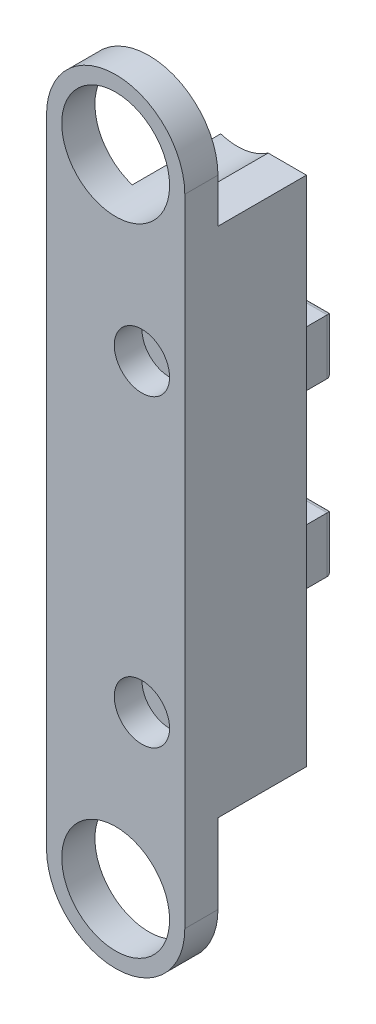
ISO-10303-21;
HEADER;
FILE_DESCRIPTION(('STEP AP214'),'2;1');
FILE_NAME('part.step','',(''),(''),'','','');
FILE_SCHEMA(('AUTOMOTIVE_DESIGN { 1 0 10303 214 1 1 1 1 }'));
ENDSEC;
DATA;
#1=APPLICATION_CONTEXT('core data for automotive mechanical design processes');
#2=APPLICATION_PROTOCOL_DEFINITION('international standard','automotive_design',2000,#1);
#3=PRODUCT_CONTEXT('',#1,'mechanical');
#4=PRODUCT('Part','Part','',(#3));
#5=PRODUCT_RELATED_PRODUCT_CATEGORY('part','',(#4));
#6=PRODUCT_DEFINITION_FORMATION('','',#4);
#7=PRODUCT_DEFINITION_CONTEXT('part definition',#1,'design');
#8=PRODUCT_DEFINITION('design','',#6,#7);
#9=PRODUCT_DEFINITION_SHAPE('','',#8);
#10=(LENGTH_UNIT() NAMED_UNIT(*) SI_UNIT(.MILLI.,.METRE.));
#11=(NAMED_UNIT(*) PLANE_ANGLE_UNIT() SI_UNIT($,.RADIAN.));
#12=(NAMED_UNIT(*) SI_UNIT($,.STERADIAN.) SOLID_ANGLE_UNIT());
#13=UNCERTAINTY_MEASURE_WITH_UNIT(LENGTH_MEASURE(1.E-05),#10,'distance_accuracy_value','');
#14=(GEOMETRIC_REPRESENTATION_CONTEXT(3) GLOBAL_UNCERTAINTY_ASSIGNED_CONTEXT((#13)) GLOBAL_UNIT_ASSIGNED_CONTEXT((#10,
#11,#12)) REPRESENTATION_CONTEXT('',''));
#15=CARTESIAN_POINT('',(0.,0.,0.));
#16=DIRECTION('',(0.,0.,1.));
#17=DIRECTION('',(1.,0.,0.));
#18=AXIS2_PLACEMENT_3D('',#15,#16,#17);
#19=CARTESIAN_POINT('',(12.5,0.,13.));
#20=DIRECTION('',(0.,0.,1.));
#21=DIRECTION('',(1.,0.,0.));
#22=AXIS2_PLACEMENT_3D('',#19,#20,#21);
#23=PLANE('',#22);
#24=DIRECTION('',(0.,-1.,0.));
#25=VECTOR('',#24,1.);
#26=CARTESIAN_POINT('',(7.24999999999999,68.,13.));
#27=LINE('',#26,#25);
#28=CARTESIAN_POINT('',(7.24999999999999,78.,13.));
#29=VERTEX_POINT('',#28);
#30=CARTESIAN_POINT('',(7.24999999999999,68.,13.));
#31=VERTEX_POINT('',#30);
#32=EDGE_CURVE('E280',#29,#31,#27,.T.);
#33=ORIENTED_EDGE('',*,*,#32,.F.);
#34=DIRECTION('',(1.,0.,0.));
#35=VECTOR('',#34,1.);
#36=CARTESIAN_POINT('',(2.24999999999999,78.,13.));
#37=LINE('',#36,#35);
#38=CARTESIAN_POINT('',(2.24999999999999,78.,13.));
#39=VERTEX_POINT('',#38);
#40=EDGE_CURVE('E289',#39,#29,#37,.T.);
#41=ORIENTED_EDGE('',*,*,#40,.F.);
#42=DIRECTION('',(0.,1.,0.));
#43=VECTOR('',#42,1.);
#44=CARTESIAN_POINT('',(2.24999999999999,68.,13.));
#45=LINE('',#44,#43);
#46=CARTESIAN_POINT('',(2.24999999999999,68.,13.));
#47=VERTEX_POINT('',#46);
#48=EDGE_CURVE('E286',#47,#39,#45,.T.);
#49=ORIENTED_EDGE('',*,*,#48,.F.);
#50=DIRECTION('',(-1.,0.,0.));
#51=VECTOR('',#50,1.);
#52=CARTESIAN_POINT('',(2.24999999999999,68.,13.));
#53=LINE('',#52,#51);
#54=EDGE_CURVE('E283',#31,#47,#53,.T.);
#55=ORIENTED_EDGE('',*,*,#54,.F.);
#56=EDGE_LOOP('',(#33,#41,#49,#55));
#57=FACE_BOUND('',#56,.T.);
#58=CARTESIAN_POINT('',(4.74999999999999,30.,13.));
#59=DIRECTION('',(0.,0.,-1.));
#60=DIRECTION('',(-1.,0.,0.));
#61=AXIS2_PLACEMENT_3D('',#58,#59,#60);
#62=CIRCLE('',#61,2.);
#63=CARTESIAN_POINT('',(2.74999999999999,30.,13.));
#64=VERTEX_POINT('',#63);
#65=EDGE_CURVE('E313',#64,#64,#62,.T.);
#66=ORIENTED_EDGE('',*,*,#65,.F.);
#67=EDGE_LOOP('',(#66));
#68=FACE_BOUND('',#67,.T.);
#69=CARTESIAN_POINT('',(4.74999999999999,85.,13.));
#70=DIRECTION('',(0.,0.,-1.));
#71=DIRECTION('',(-1.,0.,0.));
#72=AXIS2_PLACEMENT_3D('',#69,#70,#71);
#73=CIRCLE('',#72,2.);
#74=CARTESIAN_POINT('',(2.74999999999999,85.,13.));
#75=VERTEX_POINT('',#74);
#76=EDGE_CURVE('E317',#75,#75,#73,.T.);
#77=ORIENTED_EDGE('',*,*,#76,.F.);
#78=EDGE_LOOP('',(#77));
#79=FACE_BOUND('',#78,.T.);
#80=DIRECTION('',(0.,1.,0.));
#81=VECTOR('',#80,1.);
#82=CARTESIAN_POINT('',(12.5,0.,13.));
#83=LINE('',#82,#81);
#84=CARTESIAN_POINT('',(12.5,14.3653389004884,13.));
#85=VERTEX_POINT('',#84);
#86=CARTESIAN_POINT('',(12.5,107.,13.));
#87=VERTEX_POINT('',#86);
#88=EDGE_CURVE('E316',#85,#87,#83,.T.);
#89=ORIENTED_EDGE('',*,*,#88,.F.);
#90=DIRECTION('',(1.,0.,0.));
#91=VECTOR('',#90,1.);
#92=CARTESIAN_POINT('',(-2.99999999999999,14.3653389004884,13.));
#93=LINE('',#92,#91);
#94=CARTESIAN_POINT('',(-2.99999999999999,14.3653389004884,13.));
#95=VERTEX_POINT('',#94);
#96=EDGE_CURVE('E248',#95,#85,#93,.T.);
#97=ORIENTED_EDGE('',*,*,#96,.F.);
#98=DIRECTION('',(0.,1.,0.));
#99=VECTOR('',#98,1.);
#100=CARTESIAN_POINT('',(-2.99999999999999,0.,13.));
#101=LINE('',#100,#99);
#102=CARTESIAN_POINT('',(-2.99999999999999,47.9080663039864,13.));
#103=VERTEX_POINT('',#102);
#104=EDGE_CURVE('E324',#95,#103,#101,.T.);
#105=ORIENTED_EDGE('',*,*,#104,.T.);
#106=CARTESIAN_POINT('',(-13.,58.,13.));
#107=DIRECTION('',(0.,0.,1.));
#108=DIRECTION('',(1.,0.,0.));
#109=AXIS2_PLACEMENT_3D('',#106,#107,#108);
#110=CIRCLE('',#109,14.2072912873896);
#111=CARTESIAN_POINT('',(-2.99999999999999,68.0919336960136,13.));
#112=VERTEX_POINT('',#111);
#113=EDGE_CURVE('E326',#103,#112,#110,.T.);
#114=ORIENTED_EDGE('',*,*,#113,.T.);
#115=DIRECTION('',(0.,1.,0.));
#116=VECTOR('',#115,1.);
#117=CARTESIAN_POINT('',(-2.99999999999999,0.,13.));
#118=LINE('',#117,#116);
#119=CARTESIAN_POINT('',(-2.99999999999999,105.72301234236,13.));
#120=VERTEX_POINT('',#119);
#121=EDGE_CURVE('E329',#112,#120,#118,.T.);
#122=ORIENTED_EDGE('',*,*,#121,.T.);
#123=CARTESIAN_POINT('',(0.,115.,13.));
#124=DIRECTION('',(0.,0.,1.));
#125=DIRECTION('',(1.,0.,0.));
#126=AXIS2_PLACEMENT_3D('',#123,#124,#125);
#127=CIRCLE('',#126,9.75);
#128=CARTESIAN_POINT('',(5.57337420240197,107.,13.));
#129=VERTEX_POINT('',#128);
#130=EDGE_CURVE('E322',#120,#129,#127,.T.);
#131=ORIENTED_EDGE('',*,*,#130,.T.);
#132=DIRECTION('',(-1.,0.,0.));
#133=VECTOR('',#132,1.);
#134=CARTESIAN_POINT('',(0.,107.,13.));
#135=LINE('',#134,#133);
#136=EDGE_CURVE('E356',#87,#129,#135,.T.);
#137=ORIENTED_EDGE('',*,*,#136,.F.);
#138=EDGE_LOOP('',(#89,#97,#105,#114,#122,#131,#137));
#139=FACE_BOUND('',#138,.T.);
#140=DIRECTION('',(0.,-1.,0.));
#141=VECTOR('',#140,1.);
#142=CARTESIAN_POINT('',(7.24999999999999,37.,13.));
#143=LINE('',#142,#141);
#144=CARTESIAN_POINT('',(7.24999999999999,47.,13.));
#145=VERTEX_POINT('',#144);
#146=CARTESIAN_POINT('',(7.24999999999999,37.,13.));
#147=VERTEX_POINT('',#146);
#148=EDGE_CURVE('E259',#145,#147,#143,.T.);
#149=ORIENTED_EDGE('',*,*,#148,.F.);
#150=DIRECTION('',(1.,0.,0.));
#151=VECTOR('',#150,1.);
#152=CARTESIAN_POINT('',(2.24999999999999,47.,13.));
#153=LINE('',#152,#151);
#154=CARTESIAN_POINT('',(2.24999999999998,47.,13.));
#155=VERTEX_POINT('',#154);
#156=EDGE_CURVE('E269',#155,#145,#153,.T.);
#157=ORIENTED_EDGE('',*,*,#156,.F.);
#158=DIRECTION('',(0.,1.,0.));
#159=VECTOR('',#158,1.);
#160=CARTESIAN_POINT('',(2.24999999999999,37.,13.));
#161=LINE('',#160,#159);
#162=CARTESIAN_POINT('',(2.24999999999998,37.,13.));
#163=VERTEX_POINT('',#162);
#164=EDGE_CURVE('E266',#163,#155,#161,.T.);
#165=ORIENTED_EDGE('',*,*,#164,.F.);
#166=DIRECTION('',(-1.,0.,0.));
#167=VECTOR('',#166,1.);
#168=CARTESIAN_POINT('',(2.24999999999999,37.,13.));
#169=LINE('',#168,#167);
#170=EDGE_CURVE('E262',#147,#163,#169,.T.);
#171=ORIENTED_EDGE('',*,*,#170,.F.);
#172=EDGE_LOOP('',(#149,#157,#165,#171));
#173=FACE_BOUND('',#172,.T.);
#174=ADVANCED_FACE('F73',(#57,#68,#79,#139,#173),#23,.F.);
#175=CARTESIAN_POINT('',(4.74999999999999,85.,35.));
#176=DIRECTION('',(0.,0.,-1.));
#177=DIRECTION('',(-1.,0.,0.));
#178=AXIS2_PLACEMENT_3D('',#175,#176,#177);
#179=CYLINDRICAL_SURFACE('',#178,2.);
#180=ORIENTED_EDGE('',*,*,#76,.T.);
#181=EDGE_LOOP('',(#180));
#182=FACE_BOUND('',#181,.T.);
#183=CARTESIAN_POINT('',(4.74999999999999,85.,30.));
#184=DIRECTION('',(0.,0.,1.));
#185=DIRECTION('',(1.,0.,0.));
#186=AXIS2_PLACEMENT_3D('',#183,#184,#185);
#187=CIRCLE('',#186,2.);
#188=CARTESIAN_POINT('',(6.74999999999999,85.,30.));
#189=VERTEX_POINT('',#188);
#190=EDGE_CURVE('E320',#189,#189,#187,.F.);
#191=ORIENTED_EDGE('',*,*,#190,.F.);
#192=EDGE_LOOP('',(#191));
#193=FACE_BOUND('',#192,.T.);
#194=ADVANCED_FACE('F487',(#182,#193),#179,.F.);
#195=CARTESIAN_POINT('',(4.74999999999999,30.,35.));
#196=DIRECTION('',(0.,0.,-1.));
#197=DIRECTION('',(-1.,0.,0.));
#198=AXIS2_PLACEMENT_3D('',#195,#196,#197);
#199=CYLINDRICAL_SURFACE('',#198,2.);
#200=ORIENTED_EDGE('',*,*,#65,.T.);
#201=EDGE_LOOP('',(#200));
#202=FACE_BOUND('',#201,.T.);
#203=CARTESIAN_POINT('',(4.74999999999999,30.,30.));
#204=DIRECTION('',(0.,0.,1.));
#205=DIRECTION('',(1.,0.,0.));
#206=AXIS2_PLACEMENT_3D('',#203,#204,#205);
#207=CIRCLE('',#206,2.);
#208=CARTESIAN_POINT('',(6.74999999999999,30.,30.));
#209=VERTEX_POINT('',#208);
#210=EDGE_CURVE('E304',#209,#209,#207,.F.);
#211=ORIENTED_EDGE('',*,*,#210,.F.);
#212=EDGE_LOOP('',(#211));
#213=FACE_BOUND('',#212,.T.);
#214=ADVANCED_FACE('F493',(#202,#213),#199,.F.);
#215=CARTESIAN_POINT('',(0.,115.,35.));
#216=DIRECTION('',(0.,0.,-1.));
#217=DIRECTION('',(-1.,0.,0.));
#218=AXIS2_PLACEMENT_3D('',#215,#216,#217);
#219=CYLINDRICAL_SURFACE('',#218,9.75);
#220=ORIENTED_EDGE('',*,*,#130,.F.);
#221=DIRECTION('',(0.,0.,1.));
#222=VECTOR('',#221,1.);
#223=CARTESIAN_POINT('',(-2.99999999999999,105.72301234236,13.));
#224=LINE('',#223,#222);
#225=CARTESIAN_POINT('',(-2.99999999999999,105.72301234236,29.));
#226=VERTEX_POINT('',#225);
#227=EDGE_CURVE('E338',#120,#226,#224,.T.);
#228=ORIENTED_EDGE('',*,*,#227,.T.);
#229=CARTESIAN_POINT('',(0.,115.,29.));
#230=DIRECTION('',(0.,0.,1.));
#231=DIRECTION('',(1.,0.,0.));
#232=AXIS2_PLACEMENT_3D('',#229,#230,#231);
#233=CIRCLE('',#232,9.75);
#234=CARTESIAN_POINT('',(5.57337420240197,107.,29.));
#235=VERTEX_POINT('',#234);
#236=EDGE_CURVE('E360',#226,#235,#233,.F.);
#237=ORIENTED_EDGE('',*,*,#236,.T.);
#238=DIRECTION('',(0.,0.,1.));
#239=VECTOR('',#238,1.);
#240=CARTESIAN_POINT('',(5.57337420240197,107.,13.));
#241=LINE('',#240,#239);
#242=EDGE_CURVE('E241',#129,#235,#241,.T.);
#243=ORIENTED_EDGE('',*,*,#242,.F.);
#244=EDGE_LOOP('',(#220,#228,#237,#243));
#245=FACE_BOUND('',#244,.T.);
#246=CARTESIAN_POINT('',(0.,115.,35.));
#247=DIRECTION('',(0.,0.,1.));
#248=DIRECTION('',(1.,0.,0.));
#249=AXIS2_PLACEMENT_3D('',#246,#247,#248);
#250=CIRCLE('',#249,9.75);
#251=CARTESIAN_POINT('',(9.75,115.,35.));
#252=VERTEX_POINT('',#251);
#253=EDGE_CURVE('E382',#252,#252,#250,.T.);
#254=ORIENTED_EDGE('',*,*,#253,.T.);
#255=EDGE_LOOP('',(#254));
#256=FACE_BOUND('',#255,.T.);
#257=ADVANCED_FACE('F528',(#245,#256),#219,.F.);
#258=CARTESIAN_POINT('',(-12.5,0.,35.));
#259=DIRECTION('',(1.,0.,0.));
#260=DIRECTION('',(0.,1.,0.));
#261=AXIS2_PLACEMENT_3D('',#258,#259,#260);
#262=PLANE('',#261);
#263=DIRECTION('',(0.,0.,-1.));
#264=VECTOR('',#263,1.);
#265=CARTESIAN_POINT('',(-12.5,115.,35.));
#266=LINE('',#265,#264);
#267=CARTESIAN_POINT('',(-12.5,115.,35.));
#268=VERTEX_POINT('',#267);
#269=CARTESIAN_POINT('',(-12.5,115.,29.));
#270=VERTEX_POINT('',#269);
#271=EDGE_CURVE('E392',#268,#270,#266,.T.);
#272=ORIENTED_EDGE('',*,*,#271,.T.);
#273=DIRECTION('',(0.,-1.,0.));
#274=VECTOR('',#273,1.);
#275=CARTESIAN_POINT('',(-12.5,0.,29.));
#276=LINE('',#275,#274);
#277=CARTESIAN_POINT('',(-12.5,0.,29.));
#278=VERTEX_POINT('',#277);
#279=EDGE_CURVE('E240',#270,#278,#276,.T.);
#280=ORIENTED_EDGE('',*,*,#279,.T.);
#281=DIRECTION('',(0.,0.,-1.));
#282=VECTOR('',#281,1.);
#283=CARTESIAN_POINT('',(-12.5,0.,35.));
#284=LINE('',#283,#282);
#285=CARTESIAN_POINT('',(-12.5,0.,35.));
#286=VERTEX_POINT('',#285);
#287=EDGE_CURVE('E389',#286,#278,#284,.T.);
#288=ORIENTED_EDGE('',*,*,#287,.F.);
#289=DIRECTION('',(0.,-1.,0.));
#290=VECTOR('',#289,1.);
#291=CARTESIAN_POINT('',(-12.5,0.,35.));
#292=LINE('',#291,#290);
#293=EDGE_CURVE('E378',#268,#286,#292,.T.);
#294=ORIENTED_EDGE('',*,*,#293,.F.);
#295=EDGE_LOOP('',(#272,#280,#288,#294));
#296=FACE_BOUND('',#295,.T.);
#297=ADVANCED_FACE('F531',(#296),#262,.F.);
#298=CARTESIAN_POINT('',(12.5,0.,35.));
#299=DIRECTION('',(1.,0.,0.));
#300=DIRECTION('',(0.,1.,0.));
#301=AXIS2_PLACEMENT_3D('',#298,#299,#300);
#302=PLANE('',#301);
#303=DIRECTION('',(0.,0.,-1.));
#304=VECTOR('',#303,1.);
#305=CARTESIAN_POINT('',(12.5,14.3653389004884,29.));
#306=LINE('',#305,#304);
#307=CARTESIAN_POINT('',(12.5,14.3653389004884,29.));
#308=VERTEX_POINT('',#307);
#309=EDGE_CURVE('E233',#308,#85,#306,.T.);
#310=ORIENTED_EDGE('',*,*,#309,.T.);
#311=ORIENTED_EDGE('',*,*,#88,.T.);
#312=DIRECTION('',(0.,0.,1.));
#313=VECTOR('',#312,1.);
#314=CARTESIAN_POINT('',(12.5,107.,13.));
#315=LINE('',#314,#313);
#316=CARTESIAN_POINT('',(12.5,107.,29.));
#317=VERTEX_POINT('',#316);
#318=EDGE_CURVE('E359',#87,#317,#315,.T.);
#319=ORIENTED_EDGE('',*,*,#318,.T.);
#320=DIRECTION('',(0.,1.,0.));
#321=VECTOR('',#320,1.);
#322=CARTESIAN_POINT('',(12.5,0.,29.));
#323=LINE('',#322,#321);
#324=CARTESIAN_POINT('',(12.5,115.,29.));
#325=VERTEX_POINT('',#324);
#326=EDGE_CURVE('E363',#317,#325,#323,.T.);
#327=ORIENTED_EDGE('',*,*,#326,.T.);
#328=DIRECTION('',(0.,0.,-1.));
#329=VECTOR('',#328,1.);
#330=CARTESIAN_POINT('',(12.5,115.,35.));
#331=LINE('',#330,#329);
#332=CARTESIAN_POINT('',(12.5,115.,35.));
#333=VERTEX_POINT('',#332);
#334=EDGE_CURVE('E395',#333,#325,#331,.T.);
#335=ORIENTED_EDGE('',*,*,#334,.F.);
#336=DIRECTION('',(0.,-1.,0.));
#337=VECTOR('',#336,1.);
#338=CARTESIAN_POINT('',(12.5,0.,35.));
#339=LINE('',#338,#337);
#340=CARTESIAN_POINT('',(12.5,0.,35.));
#341=VERTEX_POINT('',#340);
#342=EDGE_CURVE('E355',#333,#341,#339,.T.);
#343=ORIENTED_EDGE('',*,*,#342,.T.);
#344=DIRECTION('',(0.,0.,-1.));
#345=VECTOR('',#344,1.);
#346=CARTESIAN_POINT('',(12.5,0.,35.));
#347=LINE('',#346,#345);
#348=CARTESIAN_POINT('',(12.5,0.,29.));
#349=VERTEX_POINT('',#348);
#350=EDGE_CURVE('E237',#341,#349,#347,.T.);
#351=ORIENTED_EDGE('',*,*,#350,.T.);
#352=DIRECTION('',(0.,1.,0.));
#353=VECTOR('',#352,1.);
#354=CARTESIAN_POINT('',(12.5,0.,29.));
#355=LINE('',#354,#353);
#356=EDGE_CURVE('E230',#349,#308,#355,.T.);
#357=ORIENTED_EDGE('',*,*,#356,.T.);
#358=EDGE_LOOP('',(#310,#311,#319,#327,#335,#343,#351,#357));
#359=FACE_BOUND('',#358,.T.);
#360=ADVANCED_FACE('F232',(#359),#302,.T.);
#361=CARTESIAN_POINT('',(0.,115.,35.));
#362=DIRECTION('',(0.,0.,-1.));
#363=DIRECTION('',(-1.,0.,0.));
#364=AXIS2_PLACEMENT_3D('',#361,#362,#363);
#365=CYLINDRICAL_SURFACE('',#364,12.5);
#366=ORIENTED_EDGE('',*,*,#334,.T.);
#367=CARTESIAN_POINT('',(0.,115.,29.));
#368=DIRECTION('',(0.,0.,1.));
#369=DIRECTION('',(1.,0.,0.));
#370=AXIS2_PLACEMENT_3D('',#367,#368,#369);
#371=CIRCLE('',#370,12.5);
#372=EDGE_CURVE('E366',#325,#270,#371,.T.);
#373=ORIENTED_EDGE('',*,*,#372,.T.);
#374=ORIENTED_EDGE('',*,*,#271,.F.);
#375=CARTESIAN_POINT('',(0.,115.,35.));
#376=DIRECTION('',(0.,0.,1.));
#377=DIRECTION('',(1.,0.,0.));
#378=AXIS2_PLACEMENT_3D('',#375,#376,#377);
#379=CIRCLE('',#378,12.5);
#380=EDGE_CURVE('E375',#333,#268,#379,.T.);
#381=ORIENTED_EDGE('',*,*,#380,.F.);
#382=EDGE_LOOP('',(#366,#373,#374,#381));
#383=FACE_BOUND('',#382,.T.);
#384=ADVANCED_FACE('F523',(#383),#365,.T.);
#385=CARTESIAN_POINT('',(0.,0.,35.));
#386=DIRECTION('',(0.,0.,1.));
#387=DIRECTION('',(1.,0.,0.));
#388=AXIS2_PLACEMENT_3D('',#385,#386,#387);
#389=PLANE('',#388);
#390=CARTESIAN_POINT('',(4.74999999999999,85.,35.));
#391=DIRECTION('',(0.,0.,1.));
#392=DIRECTION('',(1.,0.,0.));
#393=AXIS2_PLACEMENT_3D('',#390,#391,#392);
#394=CIRCLE('',#393,5.);
#395=CARTESIAN_POINT('',(9.74999999999999,85.,35.));
#396=VERTEX_POINT('',#395);
#397=EDGE_CURVE('E305',#396,#396,#394,.T.);
#398=ORIENTED_EDGE('',*,*,#397,.F.);
#399=EDGE_LOOP('',(#398));
#400=FACE_BOUND('',#399,.T.);
#401=CARTESIAN_POINT('',(4.74999999999999,30.,35.));
#402=DIRECTION('',(0.,0.,1.));
#403=DIRECTION('',(1.,0.,0.));
#404=AXIS2_PLACEMENT_3D('',#401,#402,#403);
#405=CIRCLE('',#404,5.);
#406=CARTESIAN_POINT('',(9.74999999999999,30.,35.));
#407=VERTEX_POINT('',#406);
#408=EDGE_CURVE('E300',#407,#407,#405,.T.);
#409=ORIENTED_EDGE('',*,*,#408,.F.);
#410=EDGE_LOOP('',(#409));
#411=FACE_BOUND('',#410,.T.);
#412=ORIENTED_EDGE('',*,*,#380,.T.);
#413=ORIENTED_EDGE('',*,*,#293,.T.);
#414=CARTESIAN_POINT('',(0.,0.,35.));
#415=DIRECTION('',(0.,0.,1.));
#416=DIRECTION('',(1.,0.,0.));
#417=AXIS2_PLACEMENT_3D('',#414,#415,#416);
#418=CIRCLE('',#417,12.5);
#419=EDGE_CURVE('E380',#286,#341,#418,.T.);
#420=ORIENTED_EDGE('',*,*,#419,.T.);
#421=ORIENTED_EDGE('',*,*,#342,.F.);
#422=EDGE_LOOP('',(#412,#413,#420,#421));
#423=FACE_BOUND('',#422,.T.);
#424=ORIENTED_EDGE('',*,*,#253,.F.);
#425=EDGE_LOOP('',(#424));
#426=FACE_BOUND('',#425,.T.);
#427=CARTESIAN_POINT('',(0.,0.,35.));
#428=DIRECTION('',(0.,0.,1.));
#429=DIRECTION('',(1.,0.,0.));
#430=AXIS2_PLACEMENT_3D('',#427,#428,#429);
#431=CIRCLE('',#430,9.75);
#432=CARTESIAN_POINT('',(9.75,0.,35.));
#433=VERTEX_POINT('',#432);
#434=EDGE_CURVE('E385',#433,#433,#431,.T.);
#435=ORIENTED_EDGE('',*,*,#434,.F.);
#436=EDGE_LOOP('',(#435));
#437=FACE_BOUND('',#436,.T.);
#438=ADVANCED_FACE('F516',(#400,#411,#423,#426,#437),#389,.T.);
#439=CARTESIAN_POINT('',(0.,0.,35.));
#440=DIRECTION('',(0.,0.,-1.));
#441=DIRECTION('',(-1.,0.,0.));
#442=AXIS2_PLACEMENT_3D('',#439,#440,#441);
#443=CYLINDRICAL_SURFACE('',#442,12.5);
#444=ORIENTED_EDGE('',*,*,#287,.T.);
#445=CARTESIAN_POINT('',(0.,0.,29.));
#446=DIRECTION('',(0.,0.,1.));
#447=DIRECTION('',(1.,0.,0.));
#448=AXIS2_PLACEMENT_3D('',#445,#446,#447);
#449=CIRCLE('',#448,12.5);
#450=EDGE_CURVE('E350',#278,#349,#449,.T.);
#451=ORIENTED_EDGE('',*,*,#450,.T.);
#452=ORIENTED_EDGE('',*,*,#350,.F.);
#453=ORIENTED_EDGE('',*,*,#419,.F.);
#454=EDGE_LOOP('',(#444,#451,#452,#453));
#455=FACE_BOUND('',#454,.T.);
#456=ADVANCED_FACE('F522',(#455),#443,.T.);
#457=CARTESIAN_POINT('',(0.,0.,35.));
#458=DIRECTION('',(0.,0.,-1.));
#459=DIRECTION('',(-1.,0.,0.));
#460=AXIS2_PLACEMENT_3D('',#457,#458,#459);
#461=CYLINDRICAL_SURFACE('',#460,9.75);
#462=CARTESIAN_POINT('',(0.,0.,29.));
#463=DIRECTION('',(0.,0.,1.));
#464=DIRECTION('',(1.,0.,0.));
#465=AXIS2_PLACEMENT_3D('',#462,#463,#464);
#466=CIRCLE('',#465,9.75);
#467=CARTESIAN_POINT('',(9.75,0.,29.));
#468=VERTEX_POINT('',#467);
#469=EDGE_CURVE('E352',#468,#468,#466,.F.);
#470=ORIENTED_EDGE('',*,*,#469,.T.);
#471=EDGE_LOOP('',(#470));
#472=FACE_BOUND('',#471,.T.);
#473=ORIENTED_EDGE('',*,*,#434,.T.);
#474=EDGE_LOOP('',(#473));
#475=FACE_BOUND('',#474,.T.);
#476=ADVANCED_FACE('F515',(#472,#475),#461,.F.);
#477=CARTESIAN_POINT('',(0.,0.,29.));
#478=DIRECTION('',(0.,0.,1.));
#479=DIRECTION('',(1.,0.,0.));
#480=AXIS2_PLACEMENT_3D('',#477,#478,#479);
#481=PLANE('',#480);
#482=DIRECTION('',(0.,1.,0.));
#483=VECTOR('',#482,1.);
#484=CARTESIAN_POINT('',(-2.99999999999999,0.,29.));
#485=LINE('',#484,#483);
#486=CARTESIAN_POINT('',(-2.99999999999999,14.3653389004884,29.));
#487=VERTEX_POINT('',#486);
#488=CARTESIAN_POINT('',(-2.99999999999999,47.9080663039864,29.));
#489=VERTEX_POINT('',#488);
#490=EDGE_CURVE('E255',#487,#489,#485,.T.);
#491=ORIENTED_EDGE('',*,*,#490,.F.);
#492=DIRECTION('',(1.,0.,0.));
#493=VECTOR('',#492,1.);
#494=CARTESIAN_POINT('',(-2.99999999999999,14.3653389004884,29.));
#495=LINE('',#494,#493);
#496=EDGE_CURVE('E245',#487,#308,#495,.T.);
#497=ORIENTED_EDGE('',*,*,#496,.T.);
#498=ORIENTED_EDGE('',*,*,#356,.F.);
#499=ORIENTED_EDGE('',*,*,#450,.F.);
#500=ORIENTED_EDGE('',*,*,#279,.F.);
#501=ORIENTED_EDGE('',*,*,#372,.F.);
#502=ORIENTED_EDGE('',*,*,#326,.F.);
#503=DIRECTION('',(-1.,0.,0.));
#504=VECTOR('',#503,1.);
#505=CARTESIAN_POINT('',(0.,107.,29.));
#506=LINE('',#505,#504);
#507=EDGE_CURVE('E346',#317,#235,#506,.T.);
#508=ORIENTED_EDGE('',*,*,#507,.T.);
#509=ORIENTED_EDGE('',*,*,#236,.F.);
#510=DIRECTION('',(0.,1.,0.));
#511=VECTOR('',#510,1.);
#512=CARTESIAN_POINT('',(-2.99999999999999,0.,29.));
#513=LINE('',#512,#511);
#514=CARTESIAN_POINT('',(-2.99999999999999,68.0919336960136,29.));
#515=VERTEX_POINT('',#514);
#516=EDGE_CURVE('E327',#515,#226,#513,.T.);
#517=ORIENTED_EDGE('',*,*,#516,.F.);
#518=CARTESIAN_POINT('',(-13.,58.,29.));
#519=DIRECTION('',(0.,0.,1.));
#520=DIRECTION('',(1.,0.,0.));
#521=AXIS2_PLACEMENT_3D('',#518,#519,#520);
#522=CIRCLE('',#521,14.2072912873896);
#523=EDGE_CURVE('E333',#489,#515,#522,.T.);
#524=ORIENTED_EDGE('',*,*,#523,.F.);
#525=EDGE_LOOP('',(#491,#497,#498,#499,#500,#501,#502,#508,#509,#517,#524));
#526=FACE_BOUND('',#525,.T.);
#527=ORIENTED_EDGE('',*,*,#469,.F.);
#528=EDGE_LOOP('',(#527));
#529=FACE_BOUND('',#528,.T.);
#530=ADVANCED_FACE('F252',(#526,#529),#481,.F.);
#531=CARTESIAN_POINT('',(0.,107.,13.));
#532=DIRECTION('',(0.,1.,0.));
#533=DIRECTION('',(0.,0.,1.));
#534=AXIS2_PLACEMENT_3D('',#531,#532,#533);
#535=PLANE('',#534);
#536=ORIENTED_EDGE('',*,*,#507,.F.);
#537=ORIENTED_EDGE('',*,*,#318,.F.);
#538=ORIENTED_EDGE('',*,*,#136,.T.);
#539=ORIENTED_EDGE('',*,*,#242,.T.);
#540=EDGE_LOOP('',(#536,#537,#538,#539));
#541=FACE_BOUND('',#540,.T.);
#542=ADVANCED_FACE('F503',(#541),#535,.T.);
#543=CARTESIAN_POINT('',(-2.99999999999999,0.,13.));
#544=DIRECTION('',(1.,0.,0.));
#545=DIRECTION('',(0.,1.,0.));
#546=AXIS2_PLACEMENT_3D('',#543,#544,#545);
#547=PLANE('',#546);
#548=ORIENTED_EDGE('',*,*,#516,.T.);
#549=ORIENTED_EDGE('',*,*,#227,.F.);
#550=ORIENTED_EDGE('',*,*,#121,.F.);
#551=DIRECTION('',(0.,0.,1.));
#552=VECTOR('',#551,1.);
#553=CARTESIAN_POINT('',(-2.99999999999999,68.0919336960136,13.));
#554=LINE('',#553,#552);
#555=EDGE_CURVE('E342',#112,#515,#554,.T.);
#556=ORIENTED_EDGE('',*,*,#555,.T.);
#557=EDGE_LOOP('',(#548,#549,#550,#556));
#558=FACE_BOUND('',#557,.T.);
#559=ADVANCED_FACE('F499',(#558),#547,.F.);
#560=CARTESIAN_POINT('',(-13.,58.,13.));
#561=DIRECTION('',(0.,0.,1.));
#562=DIRECTION('',(1.,0.,0.));
#563=AXIS2_PLACEMENT_3D('',#560,#561,#562);
#564=CYLINDRICAL_SURFACE('',#563,14.2072912873896);
#565=ORIENTED_EDGE('',*,*,#523,.T.);
#566=ORIENTED_EDGE('',*,*,#555,.F.);
#567=ORIENTED_EDGE('',*,*,#113,.F.);
#568=DIRECTION('',(0.,0.,1.));
#569=VECTOR('',#568,1.);
#570=CARTESIAN_POINT('',(-2.99999999999999,47.9080663039864,13.));
#571=LINE('',#570,#569);
#572=EDGE_CURVE('E331',#103,#489,#571,.T.);
#573=ORIENTED_EDGE('',*,*,#572,.T.);
#574=EDGE_LOOP('',(#565,#566,#567,#573));
#575=FACE_BOUND('',#574,.T.);
#576=ADVANCED_FACE('F502',(#575),#564,.F.);
#577=CARTESIAN_POINT('',(-2.99999999999999,0.,13.));
#578=DIRECTION('',(1.,0.,0.));
#579=DIRECTION('',(0.,1.,0.));
#580=AXIS2_PLACEMENT_3D('',#577,#578,#579);
#581=PLANE('',#580);
#582=DIRECTION('',(0.,0.,1.));
#583=VECTOR('',#582,1.);
#584=CARTESIAN_POINT('',(-2.99999999999999,14.3653389004884,13.));
#585=LINE('',#584,#583);
#586=EDGE_CURVE('E341',#95,#487,#585,.T.);
#587=ORIENTED_EDGE('',*,*,#586,.T.);
#588=ORIENTED_EDGE('',*,*,#490,.T.);
#589=ORIENTED_EDGE('',*,*,#572,.F.);
#590=ORIENTED_EDGE('',*,*,#104,.F.);
#591=EDGE_LOOP('',(#587,#588,#589,#590));
#592=FACE_BOUND('',#591,.T.);
#593=ADVANCED_FACE('F507',(#592),#581,.F.);
#594=CARTESIAN_POINT('',(4.74999999999999,30.,30.));
#595=DIRECTION('',(0.,0.,1.));
#596=DIRECTION('',(1.,0.,0.));
#597=AXIS2_PLACEMENT_3D('',#594,#595,#596);
#598=PLANE('',#597);
#599=CARTESIAN_POINT('',(4.74999999999999,30.,30.));
#600=DIRECTION('',(0.,0.,1.));
#601=DIRECTION('',(1.,0.,0.));
#602=AXIS2_PLACEMENT_3D('',#599,#600,#601);
#603=CIRCLE('',#602,5.);
#604=CARTESIAN_POINT('',(9.74999999999999,30.,30.));
#605=VERTEX_POINT('',#604);
#606=EDGE_CURVE('E308',#605,#605,#603,.T.);
#607=ORIENTED_EDGE('',*,*,#606,.T.);
#608=EDGE_LOOP('',(#607));
#609=FACE_BOUND('',#608,.T.);
#610=ORIENTED_EDGE('',*,*,#210,.T.);
#611=EDGE_LOOP('',(#610));
#612=FACE_BOUND('',#611,.T.);
#613=ADVANCED_FACE('F511',(#609,#612),#598,.T.);
#614=CARTESIAN_POINT('',(4.74999999999999,30.,30.));
#615=DIRECTION('',(0.,0.,1.));
#616=DIRECTION('',(1.,0.,0.));
#617=AXIS2_PLACEMENT_3D('',#614,#615,#616);
#618=CYLINDRICAL_SURFACE('',#617,5.);
#619=ORIENTED_EDGE('',*,*,#606,.F.);
#620=EDGE_LOOP('',(#619));
#621=FACE_BOUND('',#620,.T.);
#622=ORIENTED_EDGE('',*,*,#408,.T.);
#623=EDGE_LOOP('',(#622));
#624=FACE_BOUND('',#623,.T.);
#625=ADVANCED_FACE('F677',(#621,#624),#618,.F.);
#626=CARTESIAN_POINT('',(4.74999999999999,85.,30.));
#627=DIRECTION('',(0.,0.,1.));
#628=DIRECTION('',(1.,0.,0.));
#629=AXIS2_PLACEMENT_3D('',#626,#627,#628);
#630=PLANE('',#629);
#631=CARTESIAN_POINT('',(4.74999999999999,85.,30.));
#632=DIRECTION('',(0.,0.,1.));
#633=DIRECTION('',(1.,0.,0.));
#634=AXIS2_PLACEMENT_3D('',#631,#632,#633);
#635=CIRCLE('',#634,5.);
#636=CARTESIAN_POINT('',(9.74999999999999,85.,30.));
#637=VERTEX_POINT('',#636);
#638=EDGE_CURVE('E301',#637,#637,#635,.T.);
#639=ORIENTED_EDGE('',*,*,#638,.T.);
#640=EDGE_LOOP('',(#639));
#641=FACE_BOUND('',#640,.T.);
#642=ORIENTED_EDGE('',*,*,#190,.T.);
#643=EDGE_LOOP('',(#642));
#644=FACE_BOUND('',#643,.T.);
#645=ADVANCED_FACE('F666',(#641,#644),#630,.T.);
#646=CARTESIAN_POINT('',(4.74999999999999,85.,30.));
#647=DIRECTION('',(0.,0.,1.));
#648=DIRECTION('',(1.,0.,0.));
#649=AXIS2_PLACEMENT_3D('',#646,#647,#648);
#650=CYLINDRICAL_SURFACE('',#649,5.);
#651=ORIENTED_EDGE('',*,*,#638,.F.);
#652=EDGE_LOOP('',(#651));
#653=FACE_BOUND('',#652,.T.);
#654=ORIENTED_EDGE('',*,*,#397,.T.);
#655=EDGE_LOOP('',(#654));
#656=FACE_BOUND('',#655,.T.);
#657=ADVANCED_FACE('F656',(#653,#656),#650,.F.);
#658=CARTESIAN_POINT('',(7.24999999999999,68.,3.));
#659=DIRECTION('',(-1.,0.,0.));
#660=DIRECTION('',(0.,0.,1.));
#661=AXIS2_PLACEMENT_3D('',#658,#659,#660);
#662=PLANE('',#661);
#663=DIRECTION('',(0.,0.,1.));
#664=VECTOR('',#663,1.);
#665=CARTESIAN_POINT('',(7.24999999999999,68.,3.));
#666=LINE('',#665,#664);
#667=CARTESIAN_POINT('',(7.24999999999999,68.,4.));
#668=VERTEX_POINT('',#667);
#669=EDGE_CURVE('E298',#668,#31,#666,.T.);
#670=ORIENTED_EDGE('',*,*,#669,.F.);
#671=DIRECTION('',(0.,-1.,0.));
#672=VECTOR('',#671,1.);
#673=CARTESIAN_POINT('',(7.24999999999999,78.,4.));
#674=LINE('',#673,#672);
#675=CARTESIAN_POINT('',(7.24999999999999,78.,4.));
#676=VERTEX_POINT('',#675);
#677=EDGE_CURVE('E12',#668,#676,#674,.F.);
#678=ORIENTED_EDGE('',*,*,#677,.T.);
#679=DIRECTION('',(0.,0.,1.));
#680=VECTOR('',#679,1.);
#681=CARTESIAN_POINT('',(7.24999999999999,78.,3.));
#682=LINE('',#681,#680);
#683=EDGE_CURVE('E292',#676,#29,#682,.T.);
#684=ORIENTED_EDGE('',*,*,#683,.T.);
#685=ORIENTED_EDGE('',*,*,#32,.T.);
#686=EDGE_LOOP('',(#670,#678,#684,#685));
#687=FACE_BOUND('',#686,.T.);
#688=ADVANCED_FACE('F463',(#687),#662,.F.);
#689=CARTESIAN_POINT('',(2.24999999999999,68.,3.));
#690=DIRECTION('',(0.,1.,0.));
#691=DIRECTION('',(0.,0.,1.));
#692=AXIS2_PLACEMENT_3D('',#689,#690,#691);
#693=PLANE('',#692);
#694=DIRECTION('',(0.,0.,1.));
#695=VECTOR('',#694,1.);
#696=CARTESIAN_POINT('',(2.24999999999999,68.,3.));
#697=LINE('',#696,#695);
#698=CARTESIAN_POINT('',(2.24999999999999,68.,4.));
#699=VERTEX_POINT('',#698);
#700=EDGE_CURVE('E296',#699,#47,#697,.T.);
#701=ORIENTED_EDGE('',*,*,#700,.F.);
#702=DIRECTION('',(-1.,0.,0.));
#703=VECTOR('',#702,1.);
#704=CARTESIAN_POINT('',(7.24999999999999,68.,4.));
#705=LINE('',#704,#703);
#706=EDGE_CURVE('E82',#699,#668,#705,.F.);
#707=ORIENTED_EDGE('',*,*,#706,.T.);
#708=ORIENTED_EDGE('',*,*,#669,.T.);
#709=ORIENTED_EDGE('',*,*,#54,.T.);
#710=EDGE_LOOP('',(#701,#707,#708,#709));
#711=FACE_BOUND('',#710,.T.);
#712=ADVANCED_FACE('F639',(#711),#693,.F.);
#713=CARTESIAN_POINT('',(2.24999999999999,68.,3.));
#714=DIRECTION('',(1.,0.,0.));
#715=DIRECTION('',(0.,0.,-1.));
#716=AXIS2_PLACEMENT_3D('',#713,#714,#715);
#717=PLANE('',#716);
#718=DIRECTION('',(0.,0.,1.));
#719=VECTOR('',#718,1.);
#720=CARTESIAN_POINT('',(2.24999999999999,78.,3.));
#721=LINE('',#720,#719);
#722=CARTESIAN_POINT('',(2.24999999999999,78.,4.));
#723=VERTEX_POINT('',#722);
#724=EDGE_CURVE('E294',#723,#39,#721,.T.);
#725=ORIENTED_EDGE('',*,*,#724,.F.);
#726=DIRECTION('',(0.,1.,0.));
#727=VECTOR('',#726,1.);
#728=CARTESIAN_POINT('',(2.24999999999999,68.,4.));
#729=LINE('',#728,#727);
#730=EDGE_CURVE('E97',#723,#699,#729,.F.);
#731=ORIENTED_EDGE('',*,*,#730,.T.);
#732=ORIENTED_EDGE('',*,*,#700,.T.);
#733=ORIENTED_EDGE('',*,*,#48,.T.);
#734=EDGE_LOOP('',(#725,#731,#732,#733));
#735=FACE_BOUND('',#734,.T.);
#736=ADVANCED_FACE('F484',(#735),#717,.F.);
#737=CARTESIAN_POINT('',(2.24999999999999,78.,3.));
#738=DIRECTION('',(0.,-1.,0.));
#739=DIRECTION('',(0.,0.,-1.));
#740=AXIS2_PLACEMENT_3D('',#737,#738,#739);
#741=PLANE('',#740);
#742=ORIENTED_EDGE('',*,*,#683,.F.);
#743=DIRECTION('',(1.,0.,0.));
#744=VECTOR('',#743,1.);
#745=CARTESIAN_POINT('',(2.24999999999999,78.,4.));
#746=LINE('',#745,#744);
#747=EDGE_CURVE('E429',#676,#723,#746,.F.);
#748=ORIENTED_EDGE('',*,*,#747,.T.);
#749=ORIENTED_EDGE('',*,*,#724,.T.);
#750=ORIENTED_EDGE('',*,*,#40,.T.);
#751=EDGE_LOOP('',(#742,#748,#749,#750));
#752=FACE_BOUND('',#751,.T.);
#753=ADVANCED_FACE('F467',(#752),#741,.F.);
#754=CARTESIAN_POINT('',(0.,0.,3.));
#755=DIRECTION('',(0.,0.,-1.));
#756=DIRECTION('',(-1.,0.,0.));
#757=AXIS2_PLACEMENT_3D('',#754,#755,#756);
#758=PLANE('',#757);
#759=DIRECTION('',(0.,1.,0.));
#760=VECTOR('',#759,1.);
#761=CARTESIAN_POINT('',(3.24999999999999,78.,3.));
#762=LINE('',#761,#760);
#763=CARTESIAN_POINT('',(3.24999999999999,69.,3.));
#764=VERTEX_POINT('',#763);
#765=CARTESIAN_POINT('',(3.24999999999999,77.,3.));
#766=VERTEX_POINT('',#765);
#767=EDGE_CURVE('E424',#764,#766,#762,.T.);
#768=ORIENTED_EDGE('',*,*,#767,.T.);
#769=DIRECTION('',(1.,0.,0.));
#770=VECTOR('',#769,1.);
#771=CARTESIAN_POINT('',(7.24999999999999,77.,3.));
#772=LINE('',#771,#770);
#773=CARTESIAN_POINT('',(6.24999999999999,77.,3.));
#774=VERTEX_POINT('',#773);
#775=EDGE_CURVE('E426',#766,#774,#772,.T.);
#776=ORIENTED_EDGE('',*,*,#775,.T.);
#777=DIRECTION('',(0.,-1.,0.));
#778=VECTOR('',#777,1.);
#779=CARTESIAN_POINT('',(6.24999999999999,68.,3.));
#780=LINE('',#779,#778);
#781=CARTESIAN_POINT('',(6.24999999999999,69.,3.));
#782=VERTEX_POINT('',#781);
#783=EDGE_CURVE('E420',#774,#782,#780,.T.);
#784=ORIENTED_EDGE('',*,*,#783,.T.);
#785=DIRECTION('',(-1.,0.,0.));
#786=VECTOR('',#785,1.);
#787=CARTESIAN_POINT('',(2.24999999999999,69.,3.));
#788=LINE('',#787,#786);
#789=EDGE_CURVE('E422',#782,#764,#788,.T.);
#790=ORIENTED_EDGE('',*,*,#789,.T.);
#791=EDGE_LOOP('',(#768,#776,#784,#790));
#792=FACE_BOUND('',#791,.T.);
#793=ADVANCED_FACE('F473',(#792),#758,.T.);
#794=CARTESIAN_POINT('',(7.24999999999999,37.,3.));
#795=DIRECTION('',(-1.,0.,0.));
#796=DIRECTION('',(0.,0.,1.));
#797=AXIS2_PLACEMENT_3D('',#794,#795,#796);
#798=PLANE('',#797);
#799=DIRECTION('',(0.,0.,1.));
#800=VECTOR('',#799,1.);
#801=CARTESIAN_POINT('',(7.24999999999999,37.,3.));
#802=LINE('',#801,#800);
#803=CARTESIAN_POINT('',(7.24999999999999,37.,4.));
#804=VERTEX_POINT('',#803);
#805=EDGE_CURVE('E278',#804,#147,#802,.T.);
#806=ORIENTED_EDGE('',*,*,#805,.F.);
#807=DIRECTION('',(0.,-1.,0.));
#808=VECTOR('',#807,1.);
#809=CARTESIAN_POINT('',(7.24999999999999,47.,4.));
#810=LINE('',#809,#808);
#811=CARTESIAN_POINT('',(7.24999999999999,47.,4.));
#812=VERTEX_POINT('',#811);
#813=EDGE_CURVE('E418',#804,#812,#810,.F.);
#814=ORIENTED_EDGE('',*,*,#813,.T.);
#815=DIRECTION('',(0.,0.,1.));
#816=VECTOR('',#815,1.);
#817=CARTESIAN_POINT('',(7.24999999999999,47.,3.));
#818=LINE('',#817,#816);
#819=EDGE_CURVE('E272',#812,#145,#818,.T.);
#820=ORIENTED_EDGE('',*,*,#819,.T.);
#821=ORIENTED_EDGE('',*,*,#148,.T.);
#822=EDGE_LOOP('',(#806,#814,#820,#821));
#823=FACE_BOUND('',#822,.T.);
#824=ADVANCED_FACE('F475',(#823),#798,.F.);
#825=CARTESIAN_POINT('',(2.24999999999999,37.,3.));
#826=DIRECTION('',(0.,1.,0.));
#827=DIRECTION('',(0.,0.,1.));
#828=AXIS2_PLACEMENT_3D('',#825,#826,#827);
#829=PLANE('',#828);
#830=DIRECTION('',(0.,0.,1.));
#831=VECTOR('',#830,1.);
#832=CARTESIAN_POINT('',(2.24999999999999,37.,3.));
#833=LINE('',#832,#831);
#834=CARTESIAN_POINT('',(2.24999999999999,37.,4.));
#835=VERTEX_POINT('',#834);
#836=EDGE_CURVE('E276',#835,#163,#833,.T.);
#837=ORIENTED_EDGE('',*,*,#836,.F.);
#838=DIRECTION('',(-1.,0.,0.));
#839=VECTOR('',#838,1.);
#840=CARTESIAN_POINT('',(7.24999999999999,37.,4.));
#841=LINE('',#840,#839);
#842=EDGE_CURVE('E416',#835,#804,#841,.F.);
#843=ORIENTED_EDGE('',*,*,#842,.T.);
#844=ORIENTED_EDGE('',*,*,#805,.T.);
#845=ORIENTED_EDGE('',*,*,#170,.T.);
#846=EDGE_LOOP('',(#837,#843,#844,#845));
#847=FACE_BOUND('',#846,.T.);
#848=ADVANCED_FACE('F481',(#847),#829,.F.);
#849=CARTESIAN_POINT('',(2.24999999999999,37.,3.));
#850=DIRECTION('',(1.,0.,0.));
#851=DIRECTION('',(0.,0.,-1.));
#852=AXIS2_PLACEMENT_3D('',#849,#850,#851);
#853=PLANE('',#852);
#854=DIRECTION('',(0.,0.,1.));
#855=VECTOR('',#854,1.);
#856=CARTESIAN_POINT('',(2.24999999999999,47.,3.));
#857=LINE('',#856,#855);
#858=CARTESIAN_POINT('',(2.24999999999999,47.,4.));
#859=VERTEX_POINT('',#858);
#860=EDGE_CURVE('E274',#859,#155,#857,.T.);
#861=ORIENTED_EDGE('',*,*,#860,.F.);
#862=DIRECTION('',(0.,1.,0.));
#863=VECTOR('',#862,1.);
#864=CARTESIAN_POINT('',(2.24999999999999,37.,4.));
#865=LINE('',#864,#863);
#866=EDGE_CURVE('E414',#859,#835,#865,.F.);
#867=ORIENTED_EDGE('',*,*,#866,.T.);
#868=ORIENTED_EDGE('',*,*,#836,.T.);
#869=ORIENTED_EDGE('',*,*,#164,.T.);
#870=EDGE_LOOP('',(#861,#867,#868,#869));
#871=FACE_BOUND('',#870,.T.);
#872=ADVANCED_FACE('F600',(#871),#853,.F.);
#873=CARTESIAN_POINT('',(2.24999999999999,47.,3.));
#874=DIRECTION('',(0.,-1.,0.));
#875=DIRECTION('',(0.,0.,-1.));
#876=AXIS2_PLACEMENT_3D('',#873,#874,#875);
#877=PLANE('',#876);
#878=ORIENTED_EDGE('',*,*,#819,.F.);
#879=DIRECTION('',(1.,0.,0.));
#880=VECTOR('',#879,1.);
#881=CARTESIAN_POINT('',(2.24999999999999,47.,4.));
#882=LINE('',#881,#880);
#883=EDGE_CURVE('E411',#812,#859,#882,.F.);
#884=ORIENTED_EDGE('',*,*,#883,.T.);
#885=ORIENTED_EDGE('',*,*,#860,.T.);
#886=ORIENTED_EDGE('',*,*,#156,.T.);
#887=EDGE_LOOP('',(#878,#884,#885,#886));
#888=FACE_BOUND('',#887,.T.);
#889=ADVANCED_FACE('F592',(#888),#877,.F.);
#890=CARTESIAN_POINT('',(0.,0.,3.));
#891=DIRECTION('',(0.,0.,-1.));
#892=DIRECTION('',(-1.,0.,0.));
#893=AXIS2_PLACEMENT_3D('',#890,#891,#892);
#894=PLANE('',#893);
#895=DIRECTION('',(0.,1.,0.));
#896=VECTOR('',#895,1.);
#897=CARTESIAN_POINT('',(3.24999999999999,47.,3.));
#898=LINE('',#897,#896);
#899=CARTESIAN_POINT('',(3.24999999999999,38.,3.));
#900=VERTEX_POINT('',#899);
#901=CARTESIAN_POINT('',(3.24999999999999,46.,3.));
#902=VERTEX_POINT('',#901);
#903=EDGE_CURVE('E406',#900,#902,#898,.T.);
#904=ORIENTED_EDGE('',*,*,#903,.T.);
#905=DIRECTION('',(1.,0.,0.));
#906=VECTOR('',#905,1.);
#907=CARTESIAN_POINT('',(7.24999999999999,46.,3.));
#908=LINE('',#907,#906);
#909=CARTESIAN_POINT('',(6.24999999999999,46.,3.));
#910=VERTEX_POINT('',#909);
#911=EDGE_CURVE('E408',#902,#910,#908,.T.);
#912=ORIENTED_EDGE('',*,*,#911,.T.);
#913=DIRECTION('',(0.,-1.,0.));
#914=VECTOR('',#913,1.);
#915=CARTESIAN_POINT('',(6.24999999999999,37.,3.));
#916=LINE('',#915,#914);
#917=CARTESIAN_POINT('',(6.24999999999999,38.,3.));
#918=VERTEX_POINT('',#917);
#919=EDGE_CURVE('E398',#910,#918,#916,.T.);
#920=ORIENTED_EDGE('',*,*,#919,.T.);
#921=DIRECTION('',(-1.,0.,0.));
#922=VECTOR('',#921,1.);
#923=CARTESIAN_POINT('',(2.24999999999999,38.,3.));
#924=LINE('',#923,#922);
#925=EDGE_CURVE('E404',#918,#900,#924,.T.);
#926=ORIENTED_EDGE('',*,*,#925,.T.);
#927=EDGE_LOOP('',(#904,#912,#920,#926));
#928=FACE_BOUND('',#927,.T.);
#929=ADVANCED_FACE('F559',(#928),#894,.T.);
#930=CARTESIAN_POINT('',(0.,38.,4.));
#931=DIRECTION('',(1.,0.,0.));
#932=DIRECTION('',(0.,0.,-1.));
#933=AXIS2_PLACEMENT_3D('',#930,#931,#932);
#934=CYLINDRICAL_SURFACE('',#933,1.);
#935=CARTESIAN_POINT('',(6.24999999999999,38.,4.));
#936=DIRECTION('',(0.707106781186547,0.707106781186547,0.));
#937=DIRECTION('',(-0.707106781186547,0.707106781186547,0.));
#938=AXIS2_PLACEMENT_3D('',#935,#936,#937);
#939=ELLIPSE('',#938,1.41421356237309,1.);
#940=EDGE_CURVE('E438',#804,#918,#939,.T.);
#941=ORIENTED_EDGE('',*,*,#940,.F.);
#942=ORIENTED_EDGE('',*,*,#842,.F.);
#943=CARTESIAN_POINT('',(3.24999999999999,38.,4.));
#944=DIRECTION('',(0.707106781186547,-0.707106781186547,0.));
#945=DIRECTION('',(0.707106781186547,0.707106781186547,0.));
#946=AXIS2_PLACEMENT_3D('',#943,#944,#945);
#947=ELLIPSE('',#946,1.41421356237309,1.);
#948=EDGE_CURVE('E263',#900,#835,#947,.F.);
#949=ORIENTED_EDGE('',*,*,#948,.F.);
#950=ORIENTED_EDGE('',*,*,#925,.F.);
#951=EDGE_LOOP('',(#941,#942,#949,#950));
#952=FACE_BOUND('',#951,.T.);
#953=ADVANCED_FACE('F555',(#952),#934,.T.);
#954=CARTESIAN_POINT('',(3.24999999999999,0.,4.));
#955=DIRECTION('',(0.,-1.,0.));
#956=DIRECTION('',(0.,0.,-1.));
#957=AXIS2_PLACEMENT_3D('',#954,#955,#956);
#958=CYLINDRICAL_SURFACE('',#957,1.);
#959=ORIENTED_EDGE('',*,*,#948,.T.);
#960=ORIENTED_EDGE('',*,*,#866,.F.);
#961=CARTESIAN_POINT('',(3.24999999999999,46.,4.));
#962=DIRECTION('',(-0.707106781186547,-0.707106781186547,0.));
#963=DIRECTION('',(0.707106781186547,-0.707106781186547,0.));
#964=AXIS2_PLACEMENT_3D('',#961,#962,#963);
#965=ELLIPSE('',#964,1.41421356237309,1.);
#966=EDGE_CURVE('E436',#902,#859,#965,.F.);
#967=ORIENTED_EDGE('',*,*,#966,.F.);
#968=ORIENTED_EDGE('',*,*,#903,.F.);
#969=EDGE_LOOP('',(#959,#960,#967,#968));
#970=FACE_BOUND('',#969,.T.);
#971=ADVANCED_FACE('F551',(#970),#958,.T.);
#972=CARTESIAN_POINT('',(6.24999999999999,0.,4.));
#973=DIRECTION('',(0.,1.,0.));
#974=DIRECTION('',(0.,0.,1.));
#975=AXIS2_PLACEMENT_3D('',#972,#973,#974);
#976=CYLINDRICAL_SURFACE('',#975,1.);
#977=ORIENTED_EDGE('',*,*,#940,.T.);
#978=ORIENTED_EDGE('',*,*,#919,.F.);
#979=CARTESIAN_POINT('',(6.24999999999999,46.,4.));
#980=DIRECTION('',(-0.707106781186547,0.707106781186547,0.));
#981=DIRECTION('',(0.707106781186547,0.707106781186547,0.));
#982=AXIS2_PLACEMENT_3D('',#979,#980,#981);
#983=ELLIPSE('',#982,1.41421356237309,1.);
#984=EDGE_CURVE('E434',#812,#910,#983,.T.);
#985=ORIENTED_EDGE('',*,*,#984,.F.);
#986=ORIENTED_EDGE('',*,*,#813,.F.);
#987=EDGE_LOOP('',(#977,#978,#985,#986));
#988=FACE_BOUND('',#987,.T.);
#989=ADVANCED_FACE('F547',(#988),#976,.T.);
#990=CARTESIAN_POINT('',(0.,46.,4.));
#991=DIRECTION('',(-1.,0.,0.));
#992=DIRECTION('',(0.,0.,1.));
#993=AXIS2_PLACEMENT_3D('',#990,#991,#992);
#994=CYLINDRICAL_SURFACE('',#993,1.);
#995=ORIENTED_EDGE('',*,*,#966,.T.);
#996=ORIENTED_EDGE('',*,*,#883,.F.);
#997=ORIENTED_EDGE('',*,*,#984,.T.);
#998=ORIENTED_EDGE('',*,*,#911,.F.);
#999=EDGE_LOOP('',(#995,#996,#997,#998));
#1000=FACE_BOUND('',#999,.T.);
#1001=ADVANCED_FACE('F544',(#1000),#994,.T.);
#1002=CARTESIAN_POINT('',(0.,69.,4.));
#1003=DIRECTION('',(1.,0.,0.));
#1004=DIRECTION('',(0.,0.,-1.));
#1005=AXIS2_PLACEMENT_3D('',#1002,#1003,#1004);
#1006=CYLINDRICAL_SURFACE('',#1005,1.);
#1007=CARTESIAN_POINT('',(6.24999999999999,69.,4.));
#1008=DIRECTION('',(0.707106781186547,0.707106781186547,0.));
#1009=DIRECTION('',(-0.707106781186547,0.707106781186547,0.));
#1010=AXIS2_PLACEMENT_3D('',#1007,#1008,#1009);
#1011=ELLIPSE('',#1010,1.41421356237309,1.);
#1012=EDGE_CURVE('E445',#668,#782,#1011,.T.);
#1013=ORIENTED_EDGE('',*,*,#1012,.F.);
#1014=ORIENTED_EDGE('',*,*,#706,.F.);
#1015=CARTESIAN_POINT('',(3.24999999999999,69.,4.));
#1016=DIRECTION('',(0.707106781186547,-0.707106781186547,0.));
#1017=DIRECTION('',(0.707106781186547,0.707106781186547,0.));
#1018=AXIS2_PLACEMENT_3D('',#1015,#1016,#1017);
#1019=ELLIPSE('',#1018,1.41421356237309,1.);
#1020=EDGE_CURVE('E77',#764,#699,#1019,.F.);
#1021=ORIENTED_EDGE('',*,*,#1020,.F.);
#1022=ORIENTED_EDGE('',*,*,#789,.F.);
#1023=EDGE_LOOP('',(#1013,#1014,#1021,#1022));
#1024=FACE_BOUND('',#1023,.T.);
#1025=ADVANCED_FACE('F75',(#1024),#1006,.T.);
#1026=CARTESIAN_POINT('',(3.24999999999999,0.,4.));
#1027=DIRECTION('',(0.,-1.,0.));
#1028=DIRECTION('',(0.,0.,-1.));
#1029=AXIS2_PLACEMENT_3D('',#1026,#1027,#1028);
#1030=CYLINDRICAL_SURFACE('',#1029,1.);
#1031=ORIENTED_EDGE('',*,*,#1020,.T.);
#1032=ORIENTED_EDGE('',*,*,#730,.F.);
#1033=CARTESIAN_POINT('',(3.24999999999999,77.,4.));
#1034=DIRECTION('',(-0.707106781186547,-0.707106781186547,0.));
#1035=DIRECTION('',(0.707106781186547,-0.707106781186547,0.));
#1036=AXIS2_PLACEMENT_3D('',#1033,#1034,#1035);
#1037=ELLIPSE('',#1036,1.41421356237309,1.);
#1038=EDGE_CURVE('E444',#766,#723,#1037,.F.);
#1039=ORIENTED_EDGE('',*,*,#1038,.F.);
#1040=ORIENTED_EDGE('',*,*,#767,.F.);
#1041=EDGE_LOOP('',(#1031,#1032,#1039,#1040));
#1042=FACE_BOUND('',#1041,.T.);
#1043=ADVANCED_FACE('F455',(#1042),#1030,.T.);
#1044=CARTESIAN_POINT('',(6.24999999999999,0.,4.));
#1045=DIRECTION('',(0.,1.,0.));
#1046=DIRECTION('',(0.,0.,1.));
#1047=AXIS2_PLACEMENT_3D('',#1044,#1045,#1046);
#1048=CYLINDRICAL_SURFACE('',#1047,1.);
#1049=ORIENTED_EDGE('',*,*,#1012,.T.);
#1050=ORIENTED_EDGE('',*,*,#783,.F.);
#1051=CARTESIAN_POINT('',(6.24999999999999,77.,4.));
#1052=DIRECTION('',(-0.707106781186547,0.707106781186547,0.));
#1053=DIRECTION('',(0.707106781186547,0.707106781186547,0.));
#1054=AXIS2_PLACEMENT_3D('',#1051,#1052,#1053);
#1055=ELLIPSE('',#1054,1.41421356237309,1.);
#1056=EDGE_CURVE('E249',#676,#774,#1055,.T.);
#1057=ORIENTED_EDGE('',*,*,#1056,.F.);
#1058=ORIENTED_EDGE('',*,*,#677,.F.);
#1059=EDGE_LOOP('',(#1049,#1050,#1057,#1058));
#1060=FACE_BOUND('',#1059,.T.);
#1061=ADVANCED_FACE('F460',(#1060),#1048,.T.);
#1062=CARTESIAN_POINT('',(0.,77.,4.));
#1063=DIRECTION('',(-1.,0.,0.));
#1064=DIRECTION('',(0.,0.,1.));
#1065=AXIS2_PLACEMENT_3D('',#1062,#1063,#1064);
#1066=CYLINDRICAL_SURFACE('',#1065,1.);
#1067=ORIENTED_EDGE('',*,*,#1038,.T.);
#1068=ORIENTED_EDGE('',*,*,#747,.F.);
#1069=ORIENTED_EDGE('',*,*,#1056,.T.);
#1070=ORIENTED_EDGE('',*,*,#775,.F.);
#1071=EDGE_LOOP('',(#1067,#1068,#1069,#1070));
#1072=FACE_BOUND('',#1071,.T.);
#1073=ADVANCED_FACE('F470',(#1072),#1066,.T.);
#1074=CARTESIAN_POINT('',(-2.99999999999999,14.3653389004884,29.));
#1075=DIRECTION('',(0.,1.,0.));
#1076=DIRECTION('',(0.,0.,1.));
#1077=AXIS2_PLACEMENT_3D('',#1074,#1075,#1076);
#1078=PLANE('',#1077);
#1079=ORIENTED_EDGE('',*,*,#96,.T.);
#1080=ORIENTED_EDGE('',*,*,#309,.F.);
#1081=ORIENTED_EDGE('',*,*,#496,.F.);
#1082=ORIENTED_EDGE('',*,*,#586,.F.);
#1083=EDGE_LOOP('',(#1079,#1080,#1081,#1082));
#1084=FACE_BOUND('',#1083,.T.);
#1085=ADVANCED_FACE('F244',(#1084),#1078,.F.);
#1086=CLOSED_SHELL('',(#174,#194,#214,#257,#297,#360,#384,#438,#456,#476,#530,#542,#559,#576,
#593,#613,#625,#645,#657,#688,#712,#736,#753,#793,#824,#848,#872,#889,#929,#953,#971,#989,#1001,
#1025,#1043,#1061,#1073,#1085));
#1087=MANIFOLD_SOLID_BREP('B2',#1086);
#1088=ADVANCED_BREP_SHAPE_REPRESENTATION('',(#18,#1087),#14);
#1089=SHAPE_DEFINITION_REPRESENTATION(#9,#1088);
ENDSEC;
END-ISO-10303-21;
